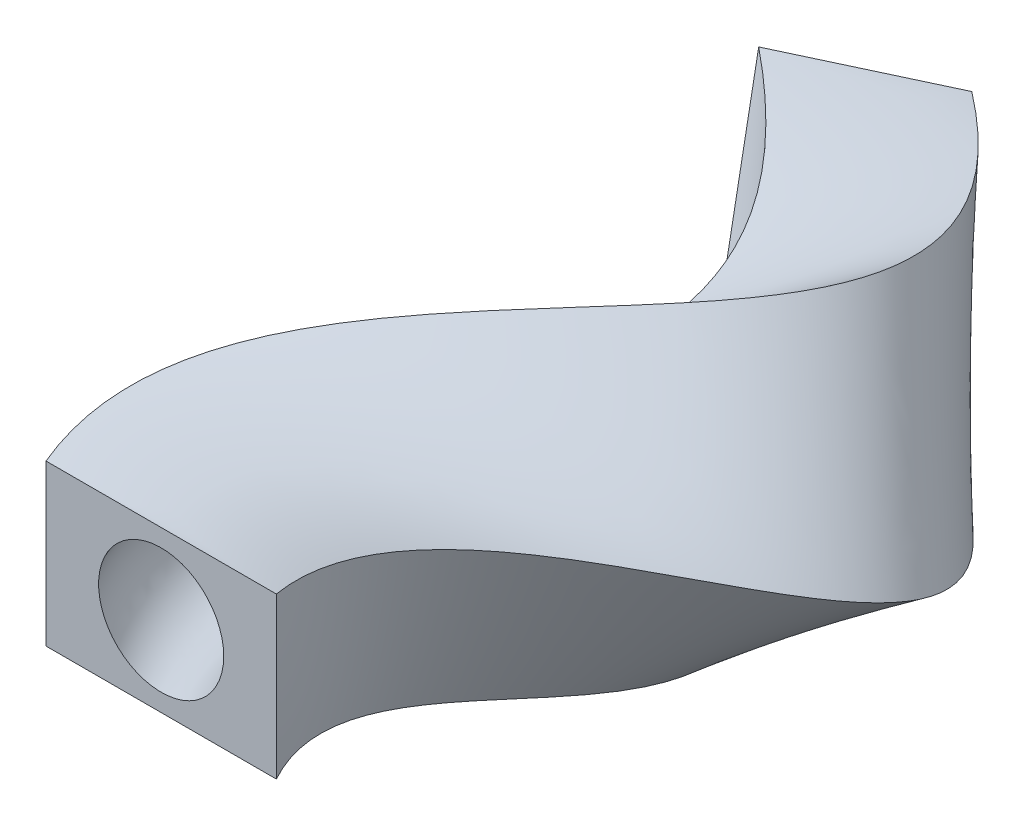
ISO-10303-21;
HEADER;
FILE_DESCRIPTION(('STEP AP214'),'2;1');
FILE_NAME('part.step','',(''),(''),'','','');
FILE_SCHEMA(('AUTOMOTIVE_DESIGN { 1 0 10303 214 1 1 1 1 }'));
ENDSEC;
DATA;
#1=APPLICATION_CONTEXT('core data for automotive mechanical design processes');
#2=APPLICATION_PROTOCOL_DEFINITION('international standard','automotive_design',2000,#1);
#3=PRODUCT_CONTEXT('',#1,'mechanical');
#4=PRODUCT('Part','Part','',(#3));
#5=PRODUCT_RELATED_PRODUCT_CATEGORY('part','',(#4));
#6=PRODUCT_DEFINITION_FORMATION('','',#4);
#7=PRODUCT_DEFINITION_CONTEXT('part definition',#1,'design');
#8=PRODUCT_DEFINITION('design','',#6,#7);
#9=PRODUCT_DEFINITION_SHAPE('','',#8);
#10=(LENGTH_UNIT() NAMED_UNIT(*) SI_UNIT(.MILLI.,.METRE.));
#11=(NAMED_UNIT(*) PLANE_ANGLE_UNIT() SI_UNIT($,.RADIAN.));
#12=(NAMED_UNIT(*) SI_UNIT($,.STERADIAN.) SOLID_ANGLE_UNIT());
#13=UNCERTAINTY_MEASURE_WITH_UNIT(LENGTH_MEASURE(1.E-05),#10,'distance_accuracy_value','');
#14=(GEOMETRIC_REPRESENTATION_CONTEXT(3) GLOBAL_UNCERTAINTY_ASSIGNED_CONTEXT((#13)) GLOBAL_UNIT_ASSIGNED_CONTEXT((#10,
#11,#12)) REPRESENTATION_CONTEXT('',''));
#15=CARTESIAN_POINT('',(0.,0.,0.));
#16=DIRECTION('',(0.,0.,1.));
#17=DIRECTION('',(1.,0.,0.));
#18=AXIS2_PLACEMENT_3D('',#15,#16,#17);
#19=CARTESIAN_POINT('',(61.2283301501087,-42.6063552254134,0.));
#20=CARTESIAN_POINT('',(38.3287198738814,-49.8660753150142,-35.7885541469527));
#21=CARTESIAN_POINT('',(38.4391921527666,-56.0138915681311,-64.3927159261914));
#22=CARTESIAN_POINT('',(55.857482325127,-65.159423486545,-114.541456645165));
#23=CARTESIAN_POINT('',(73.171139326201,-68.1534817331544,-136.088388994081));
#24=CARTESIAN_POINT('',(96.4340395376217,-70.5328991471328,-179.550974113554));
#25=CARTESIAN_POINT('',(102.389752617452,-69.9173221170335,-201.469653565411));
#26=CARTESIAN_POINT('',(74.4408587249949,-65.1683802950142,-253.135599398121));
#27=CARTESIAN_POINT('',(40.5410474525097,-61.0367607322027,-282.8866397748));
#28=CARTESIAN_POINT('',(-27.5984899072856,-55.4597251532579,-320.250022609733));
#29=CARTESIAN_POINT('',(61.2283301501087,-14.2021184084711,0.));
#30=CARTESIAN_POINT('',(41.6966039632517,-21.4618196168803,-37.3639680976946));
#31=CARTESIAN_POINT('',(45.1734788664111,-28.3489410064761,-67.5430926606875));
#32=CARTESIAN_POINT('',(68.8146629209892,-40.3401879846471,-120.602974669986));
#33=CARTESIAN_POINT('',(88.9822845483998,-45.4395553669786,-143.485024476688));
#34=CARTESIAN_POINT('',(117.00798154016,-53.0771685779317,-189.175700678509));
#35=CARTESIAN_POINT('',(124.870652816732,-55.6124093333956,-211.986477094894));
#36=CARTESIAN_POINT('',(99.4993659673522,-57.7336314010157,-264.858257131734));
#37=CARTESIAN_POINT('',(66.2706286783325,-57.3187762813602,-294.921771076642));
#38=CARTESIAN_POINT('',(-1.87034799661039,-55.459725153258,-332.285943138596));
#39=CARTESIAN_POINT('',(61.2283301501087,14.2021184084712,0.));
#40=CARTESIAN_POINT('',(45.0644284956187,6.94241720010483,-38.9394751265191));
#41=CARTESIAN_POINT('',(51.9077655799376,-0.683990445352002,-70.6934693956555));
#42=CARTESIAN_POINT('',(81.7718435169693,-15.5209524822181,-126.664492694335));
#43=CARTESIAN_POINT('',(104.793429770833,-22.7256290008615,-150.881659959763));
#44=CARTESIAN_POINT('',(137.581923542463,-35.6214380086719,-198.800427242996));
#45=CARTESIAN_POINT('',(147.351553016452,-41.3074965493174,-222.503300624378));
#46=CARTESIAN_POINT('',(124.557873209269,-50.2988825074573,-276.580914865348));
#47=CARTESIAN_POINT('',(92.0002730039314,-53.6006330371634,-306.956867766212));
#48=CARTESIAN_POINT('',(23.8577939140648,-55.4597251532581,-344.321863667458));
#49=CARTESIAN_POINT('',(61.2283301501087,42.6063552254134,0.));
#50=CARTESIAN_POINT('',(48.4322197480199,35.346635135812,-40.5150875268133));
#51=CARTESIAN_POINT('',(58.6420522935821,26.980960116008,-73.8438461303876));
#52=CARTESIAN_POINT('',(94.7290241128315,9.2982830199748,-132.726010718921));
#53=CARTESIAN_POINT('',(120.604574993267,-0.0117026347444312,-158.278295442839));
#54=CARTESIAN_POINT('',(158.155865544766,-18.1657074394121,-208.425153807483));
#55=CARTESIAN_POINT('',(169.832453215072,-27.0025837655694,-233.020124153421));
#56=CARTESIAN_POINT('',(149.616380452287,-42.8641336135688,-288.303572599401));
#57=CARTESIAN_POINT('',(117.729959910868,-49.8823223494118,-318.991941121501));
#58=CARTESIAN_POINT('',(49.58593582474,-55.4597251532582,-356.357784196321));
#59=B_SPLINE_SURFACE_WITH_KNOTS('',3,3,((#19,#20,#21,#22,#23,#24,#25,#26,#27,#28),(#29,#30,#31,
#32,#33,#34,#35,#36,#37,#38),(#39,#40,#41,#42,#43,#44,#45,#46,#47,#48),(#49,#50,#51,#52,#53,#54,
#55,#56,#57,#58)),.UNSPECIFIED.,.F.,.F.,.F.,(4,4),(4,2,2,2,4),(0.,1.),(0.,0.25,0.5,0.75,1.),.UNSPECIFIED.);
#60=CARTESIAN_POINT('',(61.2283301501087,42.6063552254134,0.));
#61=CARTESIAN_POINT('',(48.4322197480199,35.346635135812,-40.5150875268133));
#62=CARTESIAN_POINT('',(58.6420522935821,26.980960116008,-73.8438461303876));
#63=CARTESIAN_POINT('',(94.7290241128315,9.2982830199748,-132.726010718921));
#64=CARTESIAN_POINT('',(120.604574993267,-0.0117026347444312,-158.278295442839));
#65=CARTESIAN_POINT('',(158.155865544766,-18.1657074394121,-208.425153807483));
#66=CARTESIAN_POINT('',(169.832453215072,-27.0025837655694,-233.020124153421));
#67=CARTESIAN_POINT('',(149.616380452287,-42.8641336135688,-288.303572599401));
#68=CARTESIAN_POINT('',(117.729959910868,-49.8823223494118,-318.991941121501));
#69=CARTESIAN_POINT('',(49.58593582474,-55.4597251532582,-356.357784196321));
#70=B_SPLINE_CURVE_WITH_KNOTS('',3,(#60,#61,#62,#63,#64,#65,#66,#67,#68,#69),.UNSPECIFIED.,.F.,
.F.,(4,2,2,2,4),(0.,0.25,0.5,0.75,1.),.UNSPECIFIED.);
#71=CARTESIAN_POINT('',(61.2283301501087,42.6063552254134,0.));
#72=VERTEX_POINT('',#71);
#73=CARTESIAN_POINT('',(49.58593582474,-55.4597251532582,-356.357784196321));
#74=VERTEX_POINT('',#73);
#75=EDGE_CURVE('E224',#72,#74,#70,.T.);
#76=DIRECTION('',(0.,1.,0.));
#77=VECTOR('',#76,1.);
#78=CARTESIAN_POINT('',(61.2283301501087,-42.6063552254134,0.));
#79=LINE('',#78,#77);
#80=CARTESIAN_POINT('',(61.2283301501087,-42.6063552254134,0.));
#81=VERTEX_POINT('',#80);
#82=EDGE_CURVE('E116',#81,#72,#79,.T.);
#83=CARTESIAN_POINT('',(61.2283301501087,-42.6063552254134,0.));
#84=CARTESIAN_POINT('',(38.3287198738814,-49.8660753150142,-35.7885541469527));
#85=CARTESIAN_POINT('',(38.4391921527666,-56.0138915681311,-64.3927159261914));
#86=CARTESIAN_POINT('',(55.857482325127,-65.159423486545,-114.541456645165));
#87=CARTESIAN_POINT('',(73.171139326201,-68.1534817331544,-136.088388994081));
#88=CARTESIAN_POINT('',(96.4340395376217,-70.5328991471328,-179.550974113554));
#89=CARTESIAN_POINT('',(102.389752617452,-69.9173221170335,-201.469653565411));
#90=CARTESIAN_POINT('',(74.4408587249949,-65.1683802950142,-253.135599398121));
#91=CARTESIAN_POINT('',(40.5410474525097,-61.0367607322027,-282.8866397748));
#92=CARTESIAN_POINT('',(-27.5984899072856,-55.4597251532579,-320.250022609733));
#93=B_SPLINE_CURVE_WITH_KNOTS('',3,(#83,#84,#85,#86,#87,#88,#89,#90,#91,#92),.UNSPECIFIED.,.F.,
.F.,(4,2,2,2,4),(0.,0.25,0.5,0.75,1.),.UNSPECIFIED.);
#94=CARTESIAN_POINT('',(-27.5984899072856,-55.4597251532579,-320.250022609733));
#95=VERTEX_POINT('',#94);
#96=EDGE_CURVE('E113',#81,#95,#93,.T.);
#97=DIRECTION('',(0.90578536140528,0.,-0.423736803999731));
#98=VECTOR('',#97,1.);
#99=CARTESIAN_POINT('',(-27.5984899072856,-55.4597251532579,-320.250022609733));
#100=LINE('',#99,#98);
#101=EDGE_CURVE('E232',#95,#74,#100,.T.);
#102=ORIENTED_EDGE('',*,*,#75,.F.);
#103=ORIENTED_EDGE('',*,*,#82,.F.);
#104=ORIENTED_EDGE('',*,*,#96,.T.);
#105=ORIENTED_EDGE('',*,*,#101,.T.);
#106=EDGE_LOOP('',(#102,#103,#104,#105));
#107=FACE_BOUND('',#106,.T.);
#108=ADVANCED_FACE('F35',(#107),#59,.F.);
#109=CARTESIAN_POINT('',(61.2283301501087,42.6063552254134,0.));
#110=CARTESIAN_POINT('',(48.4322197480199,35.346635135812,-40.5150875268133));
#111=CARTESIAN_POINT('',(58.6420522935821,26.980960116008,-73.8438461303876));
#112=CARTESIAN_POINT('',(94.7290241128315,9.2982830199748,-132.726010718921));
#113=CARTESIAN_POINT('',(120.604574993267,-0.0117026347444312,-158.278295442839));
#114=CARTESIAN_POINT('',(158.155865544766,-18.1657074394121,-208.425153807483));
#115=CARTESIAN_POINT('',(169.832453215072,-27.0025837655694,-233.020124153421));
#116=CARTESIAN_POINT('',(149.616380452287,-42.8641336135688,-288.303572599401));
#117=CARTESIAN_POINT('',(117.729959910868,-49.8823223494118,-318.991941121501));
#118=CARTESIAN_POINT('',(49.58593582474,-55.4597251532582,-356.357784196321));
#119=CARTESIAN_POINT('',(20.4094433833696,42.6063552254134,0.));
#120=CARTESIAN_POINT('',(7.61338996696172,40.1864593054936,-40.5149070968973));
#121=CARTESIAN_POINT('',(18.6948137694612,36.6586039333824,-74.2516131976313));
#122=CARTESIAN_POINT('',(58.1369981481672,27.9186631754982,-134.703384789761));
#123=CARTESIAN_POINT('',(86.4947932127034,22.7100254877321,-161.416891875638));
#124=CARTESIAN_POINT('',(130.245708186668,11.4004947562593,-214.464005810105));
#125=CARTESIAN_POINT('',(145.637236807677,5.30405152842987,-240.796868235729));
#126=CARTESIAN_POINT('',(133.521363710032,-6.8532956438394,-299.869683195504));
#127=CARTESIAN_POINT('',(106.01655503443,-12.9091956922153,-332.608111191801));
#128=CARTESIAN_POINT('',(42.2567871855886,-18.4865750510861,-372.024668654417));
#129=CARTESIAN_POINT('',(-20.4094433833696,42.6063552254134,0.));
#130=CARTESIAN_POINT('',(-33.2054967996203,45.0262511453319,-40.514907096875));
#131=CARTESIAN_POINT('',(-21.2524247547482,46.3362477506387,-74.659380265111));
#132=CARTESIAN_POINT('',(21.5449721835914,46.5390433311396,-136.680758860365));
#133=CARTESIAN_POINT('',(52.385011432375,45.4317536102086,-164.555488309376));
#134=CARTESIAN_POINT('',(102.335550828336,40.9666969519307,-220.502857811788));
#135=CARTESIAN_POINT('',(121.442020400062,37.6106868223191,-248.573612317156));
#136=CARTESIAN_POINT('',(117.426346967998,29.1575423260001,-311.435793792486));
#137=CARTESIAN_POINT('',(94.3032236275085,24.0639344048109,-346.224272925668));
#138=CARTESIAN_POINT('',(34.9276385464371,18.4865750510859,-387.691553112514));
#139=CARTESIAN_POINT('',(-61.2283301501087,42.6063552254134,0.));
#140=CARTESIAN_POINT('',(-74.0244405525238,49.8660753150297,-40.5150875268965));
#141=CARTESIAN_POINT('',(-61.1996632788985,56.0138915678951,-75.0671473323547));
#142=CARTESIAN_POINT('',(-15.0470537810434,65.159423486781,-138.658132931205));
#143=CARTESIAN_POINT('',(18.2752296518119,68.1534817326851,-167.694084742174));
#144=CARTESIAN_POINT('',(74.4253934702384,70.5328991476021,-226.54170981441));
#145=CARTESIAN_POINT('',(97.2468039924473,69.9173221161533,-256.350356399464));
#146=CARTESIAN_POINT('',(101.331330225963,65.1683802958945,-323.001904388589));
#147=CARTESIAN_POINT('',(82.5899708727856,61.0370692877225,-359.840412020637));
#148=CARTESIAN_POINT('',(27.5984899072856,55.4597251532579,-403.358437570611));
#149=B_SPLINE_SURFACE_WITH_KNOTS('',3,3,((#109,#110,#111,#112,#113,#114,#115,#116,#117,#118),
(#119,#120,#121,#122,#123,#124,#125,#126,#127,#128),(#129,#130,#131,#132,#133,#134,#135,#136,
#137,#138),(#139,#140,#141,#142,#143,#144,#145,#146,#147,#148)),.UNSPECIFIED.,.F.,.F.,.F.,(4,4),
(4,2,2,2,4),(0.,1.),(0.,0.25,0.5,0.75,1.),.UNSPECIFIED.);
#150=CARTESIAN_POINT('',(-61.2283301501087,42.6063552254134,0.));
#151=CARTESIAN_POINT('',(-74.0244405525238,49.8660753150297,-40.5150875268965));
#152=CARTESIAN_POINT('',(-61.1996632788985,56.0138915678951,-75.0671473323547));
#153=CARTESIAN_POINT('',(-15.0470537810434,65.159423486781,-138.658132931205));
#154=CARTESIAN_POINT('',(18.2752296518119,68.1534817326851,-167.694084742174));
#155=CARTESIAN_POINT('',(74.4253934702384,70.5328991476021,-226.54170981441));
#156=CARTESIAN_POINT('',(97.2468039924473,69.9173221161533,-256.350356399464));
#157=CARTESIAN_POINT('',(101.331330225963,65.1683802958945,-323.001904388589));
#158=CARTESIAN_POINT('',(82.5899708727856,61.0370692877225,-359.840412020637));
#159=CARTESIAN_POINT('',(27.5984899072856,55.4597251532579,-403.358437570611));
#160=B_SPLINE_CURVE_WITH_KNOTS('',3,(#150,#151,#152,#153,#154,#155,#156,#157,#158,#159),
.UNSPECIFIED.,.F.,.F.,(4,2,2,2,4),(0.,0.25,0.5,0.75,1.),.UNSPECIFIED.);
#161=CARTESIAN_POINT('',(-61.2283301501087,42.6063552254134,0.));
#162=VERTEX_POINT('',#161);
#163=CARTESIAN_POINT('',(27.5984899072856,55.4597251532579,-403.358437570611));
#164=VERTEX_POINT('',#163);
#165=EDGE_CURVE('E107',#162,#164,#160,.T.);
#166=DIRECTION('',(-1.,0.,0.));
#167=VECTOR('',#166,1.);
#168=CARTESIAN_POINT('',(61.2283301501087,42.6063552254134,0.));
#169=LINE('',#168,#167);
#170=EDGE_CURVE('E89',#72,#162,#169,.T.);
#171=DIRECTION('',(-0.179552879063903,0.90578536140528,-0.383814594151616));
#172=VECTOR('',#171,1.);
#173=CARTESIAN_POINT('',(49.58593582474,-55.4597251532582,-356.357784196321));
#174=LINE('',#173,#172);
#175=EDGE_CURVE('E176',#74,#164,#174,.T.);
#176=ORIENTED_EDGE('',*,*,#165,.F.);
#177=ORIENTED_EDGE('',*,*,#170,.F.);
#178=ORIENTED_EDGE('',*,*,#75,.T.);
#179=ORIENTED_EDGE('',*,*,#175,.T.);
#180=EDGE_LOOP('',(#176,#177,#178,#179));
#181=FACE_BOUND('',#180,.T.);
#182=ADVANCED_FACE('F240',(#181),#149,.F.);
#183=CARTESIAN_POINT('',(-61.2283301501087,42.6063552254134,0.));
#184=CARTESIAN_POINT('',(-74.0244405525238,49.8660753150297,-40.5150875268965));
#185=CARTESIAN_POINT('',(-61.1996632788985,56.0138915678951,-75.0671473323547));
#186=CARTESIAN_POINT('',(-15.0470537810434,65.159423486781,-138.658132931205));
#187=CARTESIAN_POINT('',(18.2752296518119,68.1534817326851,-167.694084742174));
#188=CARTESIAN_POINT('',(74.4253934702384,70.5328991476021,-226.54170981441));
#189=CARTESIAN_POINT('',(97.2468039924473,69.9173221161533,-256.350356399464));
#190=CARTESIAN_POINT('',(101.331330225963,65.1683802958945,-323.001904388589));
#191=CARTESIAN_POINT('',(82.5899708727856,61.0370692877225,-359.840412020637));
#192=CARTESIAN_POINT('',(27.5984899072856,55.4597251532579,-403.358437570611));
#193=CARTESIAN_POINT('',(-61.2283301501087,14.2021184084712,0.));
#194=CARTESIAN_POINT('',(-77.3922318049194,21.4618196168468,-38.9394751265691));
#195=CARTESIAN_POINT('',(-67.933949992543,28.3489410067121,-71.9167705976227));
#196=CARTESIAN_POINT('',(-28.0042343769056,40.3401879844111,-132.59661490662));
#197=CARTESIAN_POINT('',(2.46408442949587,45.4395553666267,-160.297449259568));
#198=CARTESIAN_POINT('',(53.8514514678179,53.0771685782837,-216.916983249454));
#199=CARTESIAN_POINT('',(74.7659037929472,55.6124093324053,-245.8335328691));
#200=CARTESIAN_POINT('',(76.2728229838263,57.7336314020061,-311.279246655855));
#201=CARTESIAN_POINT('',(56.8602947011815,57.3187879945257,-347.805705648222));
#202=CARTESIAN_POINT('',(1.87034799661044,55.459725153258,-391.322517041748));
#203=CARTESIAN_POINT('',(-61.2283301501087,-14.2021184084712,0.));
#204=CARTESIAN_POINT('',(-80.7600563371826,-6.94241720009286,-37.3639680975356));
#205=CARTESIAN_POINT('',(-74.6682367061875,0.683990445351982,-68.7663938628907));
#206=CARTESIAN_POINT('',(-40.9614149727678,15.5209524822181,-126.535096882035));
#207=CARTESIAN_POINT('',(-13.3470607928202,22.7256290003922,-152.900813776492));
#208=CARTESIAN_POINT('',(33.2775094653973,35.6214380091412,-207.292256684967));
#209=CARTESIAN_POINT('',(52.285003593667,41.3074965485472,-235.316709339617));
#210=CARTESIAN_POINT('',(51.214315741469,50.2988825082276,-299.556588922242));
#211=CARTESIAN_POINT('',(31.130663965565,53.6007126425969,-335.770963310852));
#212=CARTESIAN_POINT('',(-23.8577939140648,55.4597251532581,-379.286596512886));
#213=CARTESIAN_POINT('',(-61.2283301501087,-42.6063552254134,0.));
#214=CARTESIAN_POINT('',(-84.1279404266066,-35.3466351358219,-35.7885541469067));
#215=CARTESIAN_POINT('',(-81.40252341995,-26.980960116008,-65.6160171281586));
#216=CARTESIAN_POINT('',(-53.9185955685119,-9.29828301997481,-120.47357885745));
#217=CARTESIAN_POINT('',(-29.158206015019,0.0117026342751,-145.504178293416));
#218=CARTESIAN_POINT('',(12.7035674628594,18.1657074398815,-197.667530120481));
#219=CARTESIAN_POINT('',(29.804103394607,27.0025837646892,-224.799885811014));
#220=CARTESIAN_POINT('',(26.1558084988916,42.8641336144492,-287.833931187748));
#221=CARTESIAN_POINT('',(5.40110362908267,49.8828314832076,-323.736165271325));
#222=CARTESIAN_POINT('',(-49.58593582474,55.4597251532582,-367.250675984023));
#223=B_SPLINE_SURFACE_WITH_KNOTS('',3,3,((#183,#184,#185,#186,#187,#188,#189,#190,#191,#192),
(#193,#194,#195,#196,#197,#198,#199,#200,#201,#202),(#203,#204,#205,#206,#207,#208,#209,#210,
#211,#212),(#213,#214,#215,#216,#217,#218,#219,#220,#221,#222)),.UNSPECIFIED.,.F.,.F.,.F.,(4,4),
(4,2,2,2,4),(0.,1.),(0.,0.25,0.5,0.75,1.),.UNSPECIFIED.);
#224=CARTESIAN_POINT('',(-61.2283301501087,-42.6063552254134,0.));
#225=CARTESIAN_POINT('',(-84.1279404266066,-35.3466351358219,-35.7885541469067));
#226=CARTESIAN_POINT('',(-81.40252341995,-26.980960116008,-65.6160171281586));
#227=CARTESIAN_POINT('',(-53.9185955685119,-9.29828301997481,-120.47357885745));
#228=CARTESIAN_POINT('',(-29.158206015019,0.0117026342751,-145.504178293416));
#229=CARTESIAN_POINT('',(12.7035674628594,18.1657074398815,-197.667530120481));
#230=CARTESIAN_POINT('',(29.804103394607,27.0025837646892,-224.799885811014));
#231=CARTESIAN_POINT('',(26.1558084988916,42.8641336144492,-287.833931187748));
#232=CARTESIAN_POINT('',(5.40110362908267,49.8828314832076,-323.736165271325));
#233=CARTESIAN_POINT('',(-49.58593582474,55.4597251532582,-367.250675984023));
#234=B_SPLINE_CURVE_WITH_KNOTS('',3,(#224,#225,#226,#227,#228,#229,#230,#231,#232,#233),
.UNSPECIFIED.,.F.,.F.,(4,2,2,2,4),(0.,0.25,0.5,0.75,1.),.UNSPECIFIED.);
#235=CARTESIAN_POINT('',(-61.2283301501087,-42.6063552254134,0.));
#236=VERTEX_POINT('',#235);
#237=CARTESIAN_POINT('',(-49.58593582474,55.4597251532582,-367.250675984023));
#238=VERTEX_POINT('',#237);
#239=EDGE_CURVE('E95',#236,#238,#234,.T.);
#240=DIRECTION('',(0.,-1.,0.));
#241=VECTOR('',#240,1.);
#242=CARTESIAN_POINT('',(-61.2283301501087,-42.6063552254134,0.));
#243=LINE('',#242,#241);
#244=EDGE_CURVE('E42',#162,#236,#243,.T.);
#245=DIRECTION('',(-0.90578536140528,0.,0.423736803999731));
#246=VECTOR('',#245,1.);
#247=CARTESIAN_POINT('',(-49.58593582474,55.4597251532582,-367.250675984023));
#248=LINE('',#247,#246);
#249=EDGE_CURVE('E102',#164,#238,#248,.T.);
#250=ORIENTED_EDGE('',*,*,#239,.F.);
#251=ORIENTED_EDGE('',*,*,#244,.F.);
#252=ORIENTED_EDGE('',*,*,#165,.T.);
#253=ORIENTED_EDGE('',*,*,#249,.T.);
#254=EDGE_LOOP('',(#250,#251,#252,#253));
#255=FACE_BOUND('',#254,.T.);
#256=ADVANCED_FACE('F101',(#255),#223,.F.);
#257=CARTESIAN_POINT('',(-61.2283301501087,-42.6063552254134,0.));
#258=CARTESIAN_POINT('',(-84.1279404266066,-35.3466351358219,-35.7885541469067));
#259=CARTESIAN_POINT('',(-81.40252341995,-26.980960116008,-65.6160171281586));
#260=CARTESIAN_POINT('',(-53.9185955685119,-9.29828301997481,-120.47357885745));
#261=CARTESIAN_POINT('',(-29.158206015019,0.0117026342751,-145.504178293416));
#262=CARTESIAN_POINT('',(12.7035674628594,18.1657074398815,-197.667530120481));
#263=CARTESIAN_POINT('',(29.804103394607,27.0025837646892,-224.799885811014));
#264=CARTESIAN_POINT('',(26.1558084988916,42.8641336144492,-287.833931187748));
#265=CARTESIAN_POINT('',(5.40110362908267,49.8828314832076,-323.736165271325));
#266=CARTESIAN_POINT('',(-49.58593582474,55.4597251532582,-367.250675984023));
#267=CARTESIAN_POINT('',(-20.4094433833695,-42.6063552254134,0.));
#268=CARTESIAN_POINT('',(-43.3089516783581,-40.1864593054806,-35.7883947663787));
#269=CARTESIAN_POINT('',(-41.4552848955931,-36.6586039333824,-65.2082500609149));
#270=CARTESIAN_POINT('',(-17.3265696040836,-27.9186631754982,-118.49620478661));
#271=CARTESIAN_POINT('',(4.95157576542685,-22.7100254882014,-142.365581860618));
#272=CARTESIAN_POINT('',(40.6137248210744,-11.40049475579,-191.628678117859));
#273=CARTESIAN_POINT('',(53.999319802112,-5.30405152931011,-217.023141729146));
#274=CARTESIAN_POINT('',(42.2508252410361,6.85329564471972,-276.267820591205));
#275=CARTESIAN_POINT('',(17.1142995996124,12.9096382366721,-310.119652899964));
#276=CARTESIAN_POINT('',(-42.2567871855886,18.4865750510861,-351.583791525926));
#277=CARTESIAN_POINT('',(20.4094433833695,-42.6063552254134,0.));
#278=CARTESIAN_POINT('',(-2.49006491175654,-45.0262511453449,-35.7883947663591));
#279=CARTESIAN_POINT('',(-1.50804637138383,-46.3362477506387,-64.8004829934352));
#280=CARTESIAN_POINT('',(19.2654563604922,-46.5390433311396,-116.518830716005));
#281=CARTESIAN_POINT('',(39.0613575456379,-45.4317536106779,-139.226985427349));
#282=CARTESIAN_POINT('',(68.523882179524,-40.9666969514614,-185.589826115706));
#283=CARTESIAN_POINT('',(78.194536209837,-37.6106868233093,-209.246397647278));
#284=CARTESIAN_POINT('',(58.3458419829605,-29.1575423250097,-264.701709994663));
#285=CARTESIAN_POINT('',(28.8276185709891,-24.0635598364653,-296.503138157456));
#286=CARTESIAN_POINT('',(-34.9276385464371,-18.4865750510858,-335.91690706783));
#287=CARTESIAN_POINT('',(61.2283301501087,-42.6063552254134,0.));
#288=CARTESIAN_POINT('',(38.3287198738814,-49.8660753150142,-35.7885541469527));
#289=CARTESIAN_POINT('',(38.4391921527666,-56.0138915681311,-64.3927159261914));
#290=CARTESIAN_POINT('',(55.857482325127,-65.159423486545,-114.541456645165));
#291=CARTESIAN_POINT('',(73.171139326201,-68.1534817331544,-136.088388994081));
#292=CARTESIAN_POINT('',(96.4340395376217,-70.5328991471328,-179.550974113554));
#293=CARTESIAN_POINT('',(102.389752617452,-69.9173221170335,-201.469653565411));
#294=CARTESIAN_POINT('',(74.4408587249949,-65.1683802950142,-253.135599398121));
#295=CARTESIAN_POINT('',(40.5410474525097,-61.0367607322027,-282.8866397748));
#296=CARTESIAN_POINT('',(-27.5984899072856,-55.4597251532579,-320.250022609733));
#297=B_SPLINE_SURFACE_WITH_KNOTS('',3,3,((#257,#258,#259,#260,#261,#262,#263,#264,#265,#266),
(#267,#268,#269,#270,#271,#272,#273,#274,#275,#276),(#277,#278,#279,#280,#281,#282,#283,#284,
#285,#286),(#287,#288,#289,#290,#291,#292,#293,#294,#295,#296)),.UNSPECIFIED.,.F.,.F.,.F.,(4,4),
(4,2,2,2,4),(0.,1.),(0.,0.25,0.5,0.75,1.),.UNSPECIFIED.);
#298=DIRECTION('',(0.179552879063903,-0.90578536140528,0.383814594151616));
#299=VECTOR('',#298,1.);
#300=CARTESIAN_POINT('',(-27.5984899072856,-55.4597251532579,-320.250022609733));
#301=LINE('',#300,#299);
#302=EDGE_CURVE('E132',#238,#95,#301,.T.);
#303=DIRECTION('',(1.,0.,0.));
#304=VECTOR('',#303,1.);
#305=CARTESIAN_POINT('',(61.2283301501087,-42.6063552254134,0.));
#306=LINE('',#305,#304);
#307=EDGE_CURVE('E85',#236,#81,#306,.T.);
#308=ORIENTED_EDGE('',*,*,#302,.T.);
#309=ORIENTED_EDGE('',*,*,#96,.F.);
#310=ORIENTED_EDGE('',*,*,#307,.F.);
#311=ORIENTED_EDGE('',*,*,#239,.T.);
#312=EDGE_LOOP('',(#308,#309,#310,#311));
#313=FACE_BOUND('',#312,.T.);
#314=ADVANCED_FACE('F37',(#313),#297,.F.);
#315=CARTESIAN_POINT('',(0.,0.,0.));
#316=DIRECTION('',(0.,0.,1.));
#317=DIRECTION('',(1.,0.,0.));
#318=AXIS2_PLACEMENT_3D('',#315,#316,#317);
#319=PLANE('',#318);
#320=CARTESIAN_POINT('',(0.,0.,0.));
#321=DIRECTION('',(0.,0.,1.));
#322=DIRECTION('',(1.,0.,0.));
#323=AXIS2_PLACEMENT_3D('',#320,#321,#322);
#324=CIRCLE('',#323,33.2587330318302);
#325=CARTESIAN_POINT('',(33.2587330318302,0.,0.));
#326=VERTEX_POINT('',#325);
#327=EDGE_CURVE('E49',#326,#326,#324,.F.);
#328=ORIENTED_EDGE('',*,*,#327,.T.);
#329=EDGE_LOOP('',(#328));
#330=FACE_BOUND('',#329,.T.);
#331=ORIENTED_EDGE('',*,*,#244,.T.);
#332=ORIENTED_EDGE('',*,*,#307,.T.);
#333=ORIENTED_EDGE('',*,*,#82,.T.);
#334=ORIENTED_EDGE('',*,*,#170,.T.);
#335=EDGE_LOOP('',(#331,#332,#333,#334));
#336=FACE_BOUND('',#335,.T.);
#337=ADVANCED_FACE('F83',(#330,#336),#319,.T.);
#338=CARTESIAN_POINT('',(0.,0.,-361.804230090172));
#339=DIRECTION('',(0.383814594151616,0.423736803999731,0.820447120936093));
#340=DIRECTION('',(0.179552879063903,-0.90578536140528,0.383814594151616));
#341=AXIS2_PLACEMENT_3D('',#338,#339,#340);
#342=PLANE('',#341);
#343=CARTESIAN_POINT('',(0.,0.,-361.804230090172));
#344=DIRECTION('',(0.383814594151616,0.423736803999731,0.820447120936093));
#345=DIRECTION('',(0.179552879063903,-0.90578536140528,0.383814594151616));
#346=AXIS2_PLACEMENT_3D('',#343,#344,#345);
#347=CIRCLE('',#346,33.2587330318302);
#348=CARTESIAN_POINT('',(5.97170126988285,-30.1252735191181,-349.039042969563));
#349=VERTEX_POINT('',#348);
#350=EDGE_CURVE('E11',#349,#349,#347,.F.);
#351=ORIENTED_EDGE('',*,*,#350,.F.);
#352=EDGE_LOOP('',(#351));
#353=FACE_BOUND('',#352,.T.);
#354=ORIENTED_EDGE('',*,*,#249,.F.);
#355=ORIENTED_EDGE('',*,*,#175,.F.);
#356=ORIENTED_EDGE('',*,*,#101,.F.);
#357=ORIENTED_EDGE('',*,*,#302,.F.);
#358=EDGE_LOOP('',(#354,#355,#356,#357));
#359=FACE_BOUND('',#358,.T.);
#360=ADVANCED_FACE('F193',(#353,#359),#342,.F.);
#361=CARTESIAN_POINT('',(33.2587330318302,0.,0.));
#362=CARTESIAN_POINT('',(15.4109893085496,-3.94339538804881,-38.151571556354));
#363=CARTESIAN_POINT('',(21.1682890702857,-7.88522660943356,-69.3976879758555));
#364=CARTESIAN_POINT('',(50.2199524741529,-15.171659533033,-124.988654419199));
#365=CARTESIAN_POINT('',(73.515420286574,-18.5133880300161,-149.333946624472));
#366=CARTESIAN_POINT('',(108.17057364078,-24.0901823509198,-198.125958718615));
#367=CARTESIAN_POINT('',(119.532246688075,-26.3230539469949,-222.573608382945));
#368=CARTESIAN_POINT('',(101.000118579554,-29.34119328424,-278.644825495824));
#369=CARTESIAN_POINT('',(71.1092579965913,-30.1252714975972,-310.269403145199));
#370=CARTESIAN_POINT('',(5.97170126988286,-30.1252735191181,-349.039042969563));
#371=CARTESIAN_POINT('',(33.2587330318302,-4.35355797335425,0.));
#372=CARTESIAN_POINT('',(14.8948000590795,-8.2969533613816,-37.9100922919802));
#373=CARTESIAN_POINT('',(20.1361153207811,-12.1254731217908,-68.9148252309715));
#374=CARTESIAN_POINT('',(48.2339868853314,-18.9757392310424,-124.059596888331));
#375=CARTESIAN_POINT('',(71.09202346044,-21.9947839877826,-148.200253732534));
#376=CARTESIAN_POINT('',(105.01717614502,-26.7656471236484,-196.650763121942));
#377=CARTESIAN_POINT('',(116.086566983991,-28.5155883745288,-220.96167980927));
#378=CARTESIAN_POINT('',(97.1593653599189,-30.4807278731932,-276.848076990786));
#379=CARTESIAN_POINT('',(67.1656374301696,-30.695153911347,-308.424778183088));
#380=CARTESIAN_POINT('',(2.02831218758934,-30.125273519118,-347.194280227906));
#381=CARTESIAN_POINT('',(32.3930972336086,-8.70540300755169,0.));
#382=CARTESIAN_POINT('',(13.5131777809855,-12.5461624359361,-37.6687086970326));
#383=CARTESIAN_POINT('',(18.2571967130532,-16.158819935672,-68.4407998851511));
#384=CARTESIAN_POINT('',(45.4728048578446,-22.3834444980212,-123.172838573044));
#385=CARTESIAN_POINT('',(67.9462226301805,-24.9929562285945,-147.13356631973));
#386=CARTESIAN_POINT('',(101.273135735057,-28.8130562501557,-195.304212358017));
#387=CARTESIAN_POINT('',(112.129141178473,-30.0221414972399,-219.515304903761));
#388=CARTESIAN_POINT('',(92.9788003671338,-30.8561413793953,-275.297315008912));
#389=CARTESIAN_POINT('',(62.9751673089899,-30.4807256561767,-306.869636853469));
#390=CARTESIAN_POINT('',(-2.06895273928243,-29.3411932847805,-345.682486974191));
#391=CARTESIAN_POINT('',(29.0610282171214,-16.7497292179183,0.));
#392=CARTESIAN_POINT('',(9.22731413652069,-20.1954147086767,-37.2225155293109));
#393=CARTESIAN_POINT('',(13.0890724376183,-23.203782280303,-67.5818721297286));
#394=CARTESIAN_POINT('',(38.816190980747,-27.8924749879002,-121.617578271828));
#395=CARTESIAN_POINT('',(60.683968228303,-29.570949537695,-145.294980419411));
#396=CARTESIAN_POINT('',(93.168094856761,-31.3431645825163,-193.071361255961));
#397=CARTESIAN_POINT('',(103.787285949708,-31.4362077890268,-217.171669326925));
#398=CARTESIAN_POINT('',(84.5681683893243,-30.0221414962099,-272.921504877526));
#399=CARTESIAN_POINT('',(54.7321425705849,-28.5155685750261,-304.572725697838));
#400=CARTESIAN_POINT('',(-9.95366824815124,-26.3230539464543,-343.552706612727));
#401=CARTESIAN_POINT('',(26.5959060257277,-20.4390452952326,0.));
#402=CARTESIAN_POINT('',(6.32475912000188,-23.5924482195911,-37.0178813828743));
#403=CARTESIAN_POINT('',(9.80190020617175,-26.2126259191599,-67.1973076715447));
#404=CARTESIAN_POINT('',(34.9233782243985,-29.9916326425937,-120.949688214391));
#405=CARTESIAN_POINT('',(56.5703720430998,-31.1489693609195,-144.523805336028));
#406=CARTESIAN_POINT('',(88.8102833764912,-31.8248682989681,-192.1859394503));
#407=CARTESIAN_POINT('',(99.4061386903196,-31.3431645834418,-216.275330775534));
#408=CARTESIAN_POINT('',(80.3414106287917,-28.8130562501217,-272.097391508435));
#409=CARTESIAN_POINT('',(50.6828312161095,-26.7656138045987,-303.831860816156));
#410=CARTESIAN_POINT('',(-13.7380165312887,-24.0901823514146,-342.935557482605));
#411=CARTESIAN_POINT('',(20.4390452952326,-26.5959060257277,0.));
#412=CARTESIAN_POINT('',(-0.562105401512265,-29.0193072389101,-36.6763813462882));
#413=CARTESIAN_POINT('',(2.31679922612364,-30.749525929355,-66.5759416150162));
#414=CARTESIAN_POINT('',(26.5954907682388,-32.5628342738598,-119.934056956103));
#415=CARTESIAN_POINT('',(47.9982692914708,-32.6452060819862,-143.393927355742));
#416=CARTESIAN_POINT('',(80.1409156130876,-31.1489693600228,-191.010559779001));
#417=CARTESIAN_POINT('',(90.883759480748,-29.5709495375833,-215.168714039601));
#418=CARTESIAN_POINT('',(72.4820955881776,-24.9929562278143,-271.300963812542));
#419=CARTESIAN_POINT('',(43.3389485483454,-21.9947193027826,-303.276982475904));
#420=CARTESIAN_POINT('',(-20.4202929233381,-18.5133880295211,-342.689761996517));
#421=CARTESIAN_POINT('',(16.7497292179183,-29.0610282171214,0.));
#422=CARTESIAN_POINT('',(-4.54370511130158,-31.0469974844325,-36.5396496579233));
#423=CARTESIAN_POINT('',(-1.87818445491848,-32.2757972243789,-66.3393844971601));
#424=CARTESIAN_POINT('',(22.1636927365713,-33.0338665922809,-119.586715363304));
#425=CARTESIAN_POINT('',(43.5431354811786,-32.5628342744032,-143.03566901698));
#426=CARTESIAN_POINT('',(75.8327703562226,-29.9916326421638,-190.72106437567));
#427=CARTESIAN_POINT('',(86.74588072259,-27.8924749883865,-214.95887126121));
#428=CARTESIAN_POINT('',(68.8526306132269,-22.383444497695,-271.32896284631));
#429=CARTESIAN_POINT('',(40.047266641599,-18.9756582525669,-303.463187759438));
#430=CARTESIAN_POINT('',(-23.3155918418363,-15.1716595330926,-343.061212350578));
#431=CARTESIAN_POINT('',(8.70540300755167,-32.3930972336086,0.));
#432=CARTESIAN_POINT('',(-12.983106928432,-33.4252729594451,-36.3548316630768));
#433=CARTESIAN_POINT('',(-10.5407233680989,-33.6139330009384,-66.0501774885072));
#434=CARTESIAN_POINT('',(13.4323770741841,-32.2757972243229,-119.265333800725));
#435=CARTESIAN_POINT('',(34.9662093175364,-30.7495259297738,-142.78651263661));
#436=CARTESIAN_POINT('',(67.9189083615675,-26.2126259186275,-190.782097035488));
#437=CARTESIAN_POINT('',(79.3404325111262,-23.2037822805697,-215.257745732885));
#438=CARTESIAN_POINT('',(62.7411419800569,-16.1588199352446,-272.23316648281));
#439=CARTESIAN_POINT('',(34.7205647909983,-12.1253646564091,-304.734820892318));
#440=CARTESIAN_POINT('',(-27.7781131113631,-7.88522660937369,-344.73682187448));
#441=CARTESIAN_POINT('',(4.35355797335424,-33.2587330318302,0.));
#442=CARTESIAN_POINT('',(-17.437588400846,-33.7749224533652,-36.3068179661921));
#443=CARTESIAN_POINT('',(-15.0048702610128,-33.4252709831093,-65.9976413881323));
#444=CARTESIAN_POINT('',(9.13629484326288,-31.0469938059468,-119.291420281053));
#445=CARTESIAN_POINT('',(30.8477916183379,-29.0193028523407,-142.89571262741));
#446=CARTESIAN_POINT('',(64.3163053905766,-23.592442790513,-191.132601084879));
#447=CARTESIAN_POINT('',(76.075776785101,-20.1954089223157,-215.766345388509));
#448=CARTESIAN_POINT('',(60.2615229320051,-12.546156226873,-273.109015320123));
#449=CARTESIAN_POINT('',(32.6876405607736,-8.29682883549209,-305.81974774767));
#450=CARTESIAN_POINT('',(-29.3435796508307,-3.9433890822934,-346.040321763526));
#451=CARTESIAN_POINT('',(-4.35355797335426,-33.2587330318302,0.));
#452=CARTESIAN_POINT('',(-26.1447043476041,-32.7425436102949,-36.3068179662136));
#453=CARTESIAN_POINT('',(-23.5260540838007,-31.360923484157,-66.0846225729105));
#454=CARTESIAN_POINT('',(1.33081463456918,-27.0750626282467,-119.713215843598));
#455=CARTESIAN_POINT('',(23.5718013009045,-24.1725092000728,-143.565209647645));
#456=CARTESIAN_POINT('',(58.3627629141822,-17.2856477989939,-192.420754406232));
#457=CARTESIAN_POINT('',(70.9146719312585,-13.3040495141488,-217.425210139043));
#458=CARTESIAN_POINT('',(56.8282794500234,-4.86464978760205,-275.576193481727));
#459=CARTESIAN_POINT('',(30.1890606222713,-0.410043134978017,-308.724292115401));
#460=CARTESIAN_POINT('',(-30.9069673874054,3.94338908229364,-349.382239936842));
#461=CARTESIAN_POINT('',(-8.70540300755169,-32.3930972336086,0.));
#462=CARTESIAN_POINT('',(-30.3939129435931,-31.3609215077729,-36.3548316630504));
#463=CARTESIAN_POINT('',(-27.5797382916858,-29.4860502355856,-66.2241056348261));
#464=CARTESIAN_POINT('',(-2.17551222007728,-24.3334976542689,-120.10875896713));
#465=CARTESIAN_POINT('',(20.4170914743098,-21.0578456317178,-144.125243258609));
#466=CARTESIAN_POINT('',(56.0141658733651,-13.6015173899601,-193.357896844851));
#467=CARTESIAN_POINT('',(69.0202534777939,-9.42377491980266,-218.574822541297));
#468=CARTESIAN_POINT('',(55.8760058508152,-0.798829401556291,-277.166552076977));
#469=CARTESIAN_POINT('',(29.7243879454036,3.64510315008228,-310.542765337379));
#470=CARTESIAN_POINT('',(-30.904273458198,7.88522660937393,-351.41934331902));
#471=CARTESIAN_POINT('',(-16.7497292179183,-29.0610282171214,0.));
#472=CARTESIAN_POINT('',(-38.0431635469022,-27.075058949658,-36.5396496580227));
#473=CARTESIAN_POINT('',(-34.6622940318475,-24.3334976544326,-66.6740329162791));
#474=CARTESIAN_POINT('',(-7.86684337009607,-17.7523951830332,-121.209517103849));
#475=CARTESIAN_POINT('',(15.5497405722216,-13.915447069003,-145.611468826991));
#476=CARTESIAN_POINT('',(52.9273157879415,-5.72708649675035,-195.677061161835));
#477=CARTESIAN_POINT('',(66.8892234102593,-1.37889581073168,-221.341130449895));
#478=CARTESIAN_POINT('',(55.643687717503,7.17011919206664,-280.821099253779));
#479=CARTESIAN_POINT('',(30.4343156077507,11.3676854010033,-314.638018027027));
#480=CARTESIAN_POINT('',(-29.3305160510723,15.1716595330928,-355.918793394428));
#481=CARTESIAN_POINT('',(-20.4390452952326,-26.5959060257277,0.));
#482=CARTESIAN_POINT('',(-41.4401959918737,-24.1725048128173,-36.67638134662));
#483=CARTESIAN_POINT('',(-37.6883788808701,-21.0578456313062,-66.984300108509));
#484=CARTESIAN_POINT('',(-10.0496083697019,-13.9154470685328,-121.914299015849));
#485=CARTESIAN_POINT('',(13.8390145914962,-9.89052230355038,-146.537076017961));
#486=CARTESIAN_POINT('',(52.1902772869951,-1.53988426480939,-197.058170548226));
#487=CARTESIAN_POINT('',(66.6534502656517,2.78254338754125,-222.95673753127));
#488=CARTESIAN_POINT('',(56.3637345905339,11.0701119587174,-282.883849928004));
#489=CARTESIAN_POINT('',(31.6086366710123,15.0320837215951,-316.913184716702));
#490=CARTESIAN_POINT('',(-27.7600717794912,18.5133880295213,-358.379369746189));
#491=CARTESIAN_POINT('',(-26.5959060257277,-20.4390452952326,0.));
#492=CARTESIAN_POINT('',(-46.8670529314087,-17.2856423707342,-37.0178813827924));
#493=CARTESIAN_POINT('',(-42.2540516304663,-13.6015173904882,-67.7286761368021));
#494=CARTESIAN_POINT('',(-12.7603368855281,-5.72708649710421,-123.526439278658));
#495=CARTESIAN_POINT('',(12.1213131568605,-1.53988426563205,-148.613765764224));
#496=CARTESIAN_POINT('',(52.4400645357723,6.7033718085678,-200.055274117005));
#497=CARTESIAN_POINT('',(67.8769249942174,10.7561822800581,-226.409343295959));
#498=CARTESIAN_POINT('',(59.3677101358728,18.113302522125,-287.169394440419));
#499=CARTESIAN_POINT('',(35.4189922613762,21.4147766244976,-321.575668407679));
#500=CARTESIAN_POINT('',(-23.2887595277536,24.0901823514147,-363.351351237324));
#501=CARTESIAN_POINT('',(-29.0610282171214,-16.7497292179183,0.));
#502=CARTESIAN_POINT('',(-48.8947422975711,-13.3040437270137,-37.2225155293033));
#503=CARTESIAN_POINT('',(-43.7918431337532,-9.42377491955467,-68.1624920923139));
#504=CARTESIAN_POINT('',(-13.2872338458543,-1.37889581040614,-124.433163321485));
#505=CARTESIAN_POINT('',(12.1150135448062,2.78254338732928,-149.764031230798));
#506=CARTESIAN_POINT('',(53.4267920051891,10.7561822807682,-201.670089067105));
#507=CARTESIAN_POINT('',(69.3356914826164,14.5652446878383,-228.244983525251));
#508=CARTESIAN_POINT('',(61.6504568717929,21.2537291242035,-289.39050210093));
#509=CARTESIAN_POINT('',(38.0535276910731,24.1305616852072,-323.961150416601));
#510=CARTESIAN_POINT('',(-20.3896508180342,26.3230539464544,-365.860800114293));
#511=CARTESIAN_POINT('',(-32.3930972336086,-8.70540300755168,0.));
#512=CARTESIAN_POINT('',(-51.2730166857152,-4.86464357915282,-37.6687086971746));
#513=CARTESIAN_POINT('',(-45.1455506045378,-0.798829401904989,-69.0879923645299));
#514=CARTESIAN_POINT('',(-12.6046758838152,7.17011919184134,-126.311251969854));
#515=CARTESIAN_POINT('',(13.8084660501313,11.0701119580121,-152.115027966553));
#516=CARTESIAN_POINT('',(56.9751887437805,18.1133025223319,-204.888850037904));
#517=CARTESIAN_POINT('',(73.7274080706198,21.2537291236073,-231.858259215854));
#518=CARTESIAN_POINT('',(67.4333980501758,26.298899740823,-293.654608645954));
#519=CARTESIAN_POINT('',(44.3842199904679,28.2016730193393,-328.481040044761));
#520=CARTESIAN_POINT('',(-13.7015004794652,29.3411932847806,-370.548373910254));
#521=CARTESIAN_POINT('',(-33.2587330318302,-4.35355797335424,0.));
#522=CARTESIAN_POINT('',(-51.6226660040827,-0.410162585270944,-37.9100922921649));
#523=CARTESIAN_POINT('',(-44.9609339459792,3.64498009697655,-69.5793125362278));
#524=CARTESIAN_POINT('',(-11.3954895188341,11.3675798351234,-127.281877627881));
#525=CARTESIAN_POINT('',(15.5075518656598,15.0319920713994,-153.314834218822));
#526=CARTESIAN_POINT('',(59.5354618709661,21.4147175790414,-206.491529613698));
#527=CARTESIAN_POINT('',(76.6586302177678,24.1305195186675,-233.634473007264));
#528=CARTESIAN_POINT('',(70.931317151742,28.2016586960803,-295.69592978684));
#529=CARTESIAN_POINT('',(48.0778860997572,29.5553991033099,-330.613670168994));
#530=CARTESIAN_POINT('',(-9.91509035217637,30.1252735191181,-372.724654469124));
#531=CARTESIAN_POINT('',(-33.2587330318302,4.35355797335425,0.));
#532=CARTESIAN_POINT('',(-50.5902875051329,8.29695336140594,-38.3930508209045));
#533=CARTESIAN_POINT('',(-42.8965864469698,12.1254731216482,-70.5450380259957));
#534=CARTESIAN_POINT('',(-7.423558341191,18.9757392311849,-129.139992689619));
#535=CARTESIAN_POINT('',(20.3543455180411,21.994783986819,-155.582220002699));
#536=CARTESIAN_POINT('',(65.8422568623718,26.765647124612,-209.441920807045));
#537=CARTESIAN_POINT('',(83.5499896257232,28.5155883736297,-236.85833015419));
#538=CARTESIAN_POINT('',(78.6128235912245,30.4807278740925,-299.289426797337));
#539=CARTESIAN_POINT('',(55.9651253500307,30.6951524568768,-334.302860837689));
#540=CARTESIAN_POINT('',(-2.02831218758934,30.125273519118,-376.414179952438));
#541=CARTESIAN_POINT('',(-32.3930972336086,8.70540300755165,0.));
#542=CARTESIAN_POINT('',(-49.2086658501233,12.5461624359412,-38.6344357477607));
#543=CARTESIAN_POINT('',(-41.017667839242,16.1588199355579,-71.019063371588));
#544=CARTESIAN_POINT('',(-4.66237631370422,22.3834444981352,-130.026751005134));
#545=CARTESIAN_POINT('',(23.5001463481873,24.9929562276876,-156.648907415049));
#546=CARTESIAN_POINT('',(69.586297272448,28.8130562510626,-210.788471571423));
#547=CARTESIAN_POINT('',(87.5074154314529,30.0221414963407,-238.304705058853));
#548=CARTESIAN_POINT('',(82.7933885837979,30.8561413802945,-300.840188780058));
#549=CARTESIAN_POINT('',(60.1555952220949,30.48073163051,-335.857971586308));
#550=CARTESIAN_POINT('',(2.0689527392824,29.3411932847805,-377.925973206153));
#551=CARTESIAN_POINT('',(-29.0610282171214,16.7497292179183,0.));
#552=CARTESIAN_POINT('',(-44.9228044495526,20.195414708673,-39.0806337117369));
#553=CARTESIAN_POINT('',(-35.849543563693,23.2037822801319,-71.8779911272386));
#554=CARTESIAN_POINT('',(1.99423756327934,27.8924749880712,-131.582011306121));
#555=CARTESIAN_POINT('',(30.7624007501781,29.5709495367881,-158.487493315821));
#556=CARTESIAN_POINT('',(77.6913381506308,31.3431645834232,-213.021322673026));
#557=CARTESIAN_POINT('',(95.8492706602183,31.4362077881276,-240.648340636536));
#558=CARTESIAN_POINT('',(91.2040205616074,30.0221414971092,-303.215998910598));
#559=CARTESIAN_POINT('',(68.3986209564403,28.5156127582314,-338.154831889672));
#560=CARTESIAN_POINT('',(9.95366824815121,26.3230539464543,-380.055753567617));
#561=CARTESIAN_POINT('',(-26.5959060257277,20.4390452952326,0.));
#562=CARTESIAN_POINT('',(-42.0202509355747,23.5924482195758,-39.2852710699996));
#563=CARTESIAN_POINT('',(-32.5623713323035,26.2126259189888,-72.2625555854225));
#564=CARTESIAN_POINT('',(5.88705031968486,29.9916326427648,-132.249901363558));
#565=CARTESIAN_POINT('',(34.8759969350412,31.1489693601259,-159.258668399205));
#566=CARTESIAN_POINT('',(82.0491496312408,31.8248682997617,-213.906744478687));
#567=CARTESIAN_POINT('',(100.230417919395,31.3431645825955,-241.544679187504));
#568=CARTESIAN_POINT('',(95.4307783223517,28.8130562509681,-304.040112280112));
#569=CARTESIAN_POINT('',(72.4479334944385,26.7656867406948,-338.895679158045));
#570=CARTESIAN_POINT('',(13.7380165312887,24.0901823514146,-380.672902697739));
#571=CARTESIAN_POINT('',(-20.4390452952326,26.5959060257277,0.));
#572=CARTESIAN_POINT('',(-35.1333895830698,29.0193072389309,-39.6267778808027));
#573=CARTESIAN_POINT('',(-25.0772703521984,30.7495259292409,-72.883921641951));
#574=CARTESIAN_POINT('',(14.2149377757876,32.5628342739738,-133.265532621846));
#575=CARTESIAN_POINT('',(43.4480996866703,32.6452060810793,-160.38854637949));
#576=CARTESIAN_POINT('',(90.7185173946443,31.1489693609297,-215.082124149986));
#577=CARTESIAN_POINT('',(108.752797129178,29.5709495367371,-242.65129592386));
#578=CARTESIAN_POINT('',(103.290093362754,24.9929562286607,-304.836539975581));
#579=CARTESIAN_POINT('',(79.7918194422725,21.9948575771591,-339.450544866967));
#580=CARTESIAN_POINT('',(20.4202929233381,18.5133880295211,-380.918698183827));
#581=CARTESIAN_POINT('',(-16.7497292179183,29.0610282171214,0.));
#582=CARTESIAN_POINT('',(-31.1517913736554,31.0469974844352,-39.7635127763305));
#583=CARTESIAN_POINT('',(-20.8822866710707,32.2757972242648,-73.1204787598071));
#584=CARTESIAN_POINT('',(18.6467358073695,33.0338665923949,-133.612874214645));
#585=CARTESIAN_POINT('',(47.9032334971892,32.5628342733829,-160.746804718252));
#586=CARTESIAN_POINT('',(95.0266626512827,29.991632643184,-215.371619553317));
#587=CARTESIAN_POINT('',(112.890675887125,27.8924749875402,-242.861138701828));
#588=CARTESIAN_POINT('',(106.919558337916,22.3834444985414,-304.808540942237));
#589=CARTESIAN_POINT('',(83.083503277983,18.9758296818499,-339.264345206294));
#590=CARTESIAN_POINT('',(23.3155918418363,15.1716595330926,-380.547247829766));
#591=CARTESIAN_POINT('',(-8.70540300755165,32.3930972336086,0.));
#592=CARTESIAN_POINT('',(-22.7123917941477,33.4252729594412,-39.948335555084));
#593=CARTESIAN_POINT('',(-12.2197477580043,33.6139330007103,-73.40968576846));
#594=CARTESIAN_POINT('',(27.3780514698708,32.275797224551,-133.934255777224));
#595=CARTESIAN_POINT('',(56.4801596609447,30.7495259288669,-160.995961098623));
#596=CARTESIAN_POINT('',(102.940524645824,26.2126259195344,-215.310586893499));
#597=CARTESIAN_POINT('',(120.296124098588,23.2037822796705,-242.562264230575));
#598=CARTESIAN_POINT('',(113.031046971086,16.1588199361439,-303.904337305313));
#599=CARTESIAN_POINT('',(88.4102087905107,12.1255902398556,-337.99274489575));
#600=CARTESIAN_POINT('',(27.7781131113631,7.88522660937367,-378.871638305863));
#601=CARTESIAN_POINT('',(-4.35355797335425,33.2587330318302,0.));
#602=CARTESIAN_POINT('',(-18.2579109427004,33.7749224533634,-39.9963505789646));
#603=CARTESIAN_POINT('',(-7.75560086506191,33.4252709831093,-73.4622218688349));
#604=CARTESIAN_POINT('',(31.6741337007634,31.0469938059468,-133.908169296896));
#605=CARTESIAN_POINT('',(60.5985773600298,29.0193028513771,-160.886761107822));
#606=CARTESIAN_POINT('',(106.543127616929,23.5924427914766,-214.960082844108));
#607=CARTESIAN_POINT('',(123.560779824402,20.1954089214694,-242.053664573682));
#608=CARTESIAN_POINT('',(115.51066601935,12.5461562277194,-303.02848846927));
#609=CARTESIAN_POINT('',(90.4431345686124,8.29707260340223,-336.907843521395));
#610=CARTESIAN_POINT('',(29.3435796508307,3.9433890822934,-377.568138416818));
#611=CARTESIAN_POINT('',(4.35355797335425,33.2587330318302,0.));
#612=CARTESIAN_POINT('',(-9.55079499594325,32.7425436102975,-39.9963505789302));
#613=CARTESIAN_POINT('',(0.765582957726014,31.360923484043,-73.3752406840567));
#614=CARTESIAN_POINT('',(39.4796139094571,27.0750626283608,-133.486373734351));
#615=CARTESIAN_POINT('',(67.8745676775766,24.1725091992226,-160.217264087588));
#616=CARTESIAN_POINT('',(112.49667009321,17.2856477998442,-213.671929522755));
#617=CARTESIAN_POINT('',(128.721884678244,13.304049513276,-240.394799824418));
#618=CARTESIAN_POINT('',(118.943909501332,4.8646497884749,-300.561310306396));
#619=CARTESIAN_POINT('',(92.9417164140049,0.410298320213672,-334.003358169863));
#620=CARTESIAN_POINT('',(30.9069673874054,-3.94338908229364,-374.226220243501));
#621=CARTESIAN_POINT('',(8.70540300755167,32.3930972336086,0.));
#622=CARTESIAN_POINT('',(-5.30158577897984,31.3609215077754,-39.9483355551094));
#623=CARTESIAN_POINT('',(4.81926716561106,29.4860502354145,-73.2357576221411));
#624=CARTESIAN_POINT('',(42.9859407641036,24.33349765444,-133.09083061082));
#625=CARTESIAN_POINT('',(71.029277504058,21.0578456308109,-159.657230477077));
#626=CARTESIAN_POINT('',(114.84526713414,13.601517390867,-212.734787083682));
#627=CARTESIAN_POINT('',(130.616303132238,9.42377491894316,-239.245187421317));
#628=CARTESIAN_POINT('',(119.896183100011,0.798829402415933,-298.970951711992));
#629=CARTESIAN_POINT('',(93.4063893489537,-3.64485532496954,-332.184915412347));
#630=CARTESIAN_POINT('',(30.904273458198,-7.88522660937391,-372.189116861324));
#631=CARTESIAN_POINT('',(16.7497292179183,29.0610282171214,0.));
#632=CARTESIAN_POINT('',(2.34766706192365,27.0750589496657,-39.76351277623));
#633=CARTESIAN_POINT('',(11.9018229057728,24.3334976543186,-72.7858303406881));
#634=CARTESIAN_POINT('',(48.6772719141224,17.7523951831473,-131.990072474101));
#635=CARTESIAN_POINT('',(75.8966284062596,13.9154470681528,-158.171004908695));
#636=CARTESIAN_POINT('',(117.93211721945,5.72708649760059,-210.415622766698));
#637=CARTESIAN_POINT('',(132.747333199667,1.37889580988541,-236.478879513143));
#638=CARTESIAN_POINT('',(120.128501233429,-7.17011919122022,-295.316404534768));
#639=CARTESIAN_POINT('',(92.6964606970954,-11.3674755435385,-328.089713519845));
#640=CARTESIAN_POINT('',(29.3305160510723,-15.1716595330928,-367.689666785916));
#641=CARTESIAN_POINT('',(20.4390452952326,26.5959060257277,0.));
#642=CARTESIAN_POINT('',(5.74470100722723,24.1725048128391,-39.6267778804639));
#643=CARTESIAN_POINT('',(14.9279077546813,21.0578456311921,-72.4755631484581));
#644=CARTESIAN_POINT('',(50.8600369138423,13.9154470686468,-131.2852905621));
#645=CARTESIAN_POINT('',(77.6073543867582,9.89052230272852,-157.245397717271));
#646=CARTESIAN_POINT('',(118.669155720624,1.53988426563129,-209.034513380761));
#647=CARTESIAN_POINT('',(132.98310634438,-2.78254338836108,-234.863272430921));
#648=CARTESIAN_POINT('',(119.408454360292,-11.0701119578975,-293.253653861389));
#649=CARTESIAN_POINT('',(91.5221384465108,-15.0319025053469,-325.814564516327));
#650=CARTESIAN_POINT('',(27.7600717794912,-18.5133880295213,-365.229090434155));
#651=CARTESIAN_POINT('',(26.5959060257277,20.4390452952326,0.));
#652=CARTESIAN_POINT('',(11.171561115858,17.2856423707378,-39.2852710700573));
#653=CARTESIAN_POINT('',(19.4935805042775,13.6015173903742,-71.7311871201651));
#654=CARTESIAN_POINT('',(53.5707654296685,5.72708649721826,-129.673150299291));
#655=CARTESIAN_POINT('',(79.3250558215073,1.53988426478184,-155.168707971462));
#656=CARTESIAN_POINT('',(118.419368471733,-6.70337180771756,-206.037409811528));
#657=CARTESIAN_POINT('',(131.759631615497,-10.7561822808515,-231.410666667078));
#658=CARTESIAN_POINT('',(116.404478815271,-18.1133025213315,-288.968109348127));
#659=CARTESIAN_POINT('',(87.7117795507848,-21.4146606902895,-321.152093696982));
#660=CARTESIAN_POINT('',(23.2887595277536,-24.0901823514147,-360.25710894302));
#661=CARTESIAN_POINT('',(29.0610282171214,16.7497292179183,0.));
#662=CARTESIAN_POINT('',(13.1992519845538,13.3040437270189,-39.0806337117108));
#663=CARTESIAN_POINT('',(21.0313720075645,9.42377491944061,-71.2973711646534));
#664=CARTESIAN_POINT('',(54.0976623899946,1.37889581052016,-128.766426256464));
#665=CARTESIAN_POINT('',(79.3313554334482,-2.78254338826454,-154.018442504888));
#666=CARTESIAN_POINT('',(117.43264100243,-10.756182279833,-204.422594861428));
#667=CARTESIAN_POINT('',(130.300865127098,-14.5652446886846,-229.575026437786));
#668=CARTESIAN_POINT('',(114.12173207935,-21.2537291233571,-286.747001687616));
#669=CARTESIAN_POINT('',(85.0772421866215,-24.1304789748926,-318.766606183213));
#670=CARTESIAN_POINT('',(20.3896508180342,-26.3230539464544,-357.74766006605));
#671=CARTESIAN_POINT('',(32.3930972336086,8.70540300755167,0.));
#672=CARTESIAN_POINT('',(15.5775286166068,4.86464357918514,-38.6344357475296));
#673=CARTESIAN_POINT('',(22.3850794784631,0.798829401790935,-70.3718708924373));
#674=CARTESIAN_POINT('',(53.4151044278416,-7.17011919172731,-126.888337608095));
#675=CARTESIAN_POINT('',(77.6379029284632,-11.0701119588907,-151.667445768679));
#676=CARTESIAN_POINT('',(113.884244263498,-18.1133025214534,-201.203833891083));
#677=CARTESIAN_POINT('',(125.909148539095,-21.2537291244536,-225.961750747183));
#678=CARTESIAN_POINT('',(108.338790900968,-26.2988997399767,-282.482895142592));
#679=CARTESIAN_POINT('',(78.7465462131078,-28.2016447046598,-314.246683780406));
#680=CARTESIAN_POINT('',(13.7015004794652,-29.3411932847806,-353.06008627009));
#681=CARTESIAN_POINT('',(33.2587330318302,4.35355797335425,0.));
#682=CARTESIAN_POINT('',(15.9271785580196,0.410162585283986,-38.3930508207277));
#683=CARTESIAN_POINT('',(22.2004628197904,-3.64498009707633,-69.8805507207394));
#684=CARTESIAN_POINT('',(52.2059180629744,-11.3675798350236,-125.917711950068));
#685=CARTESIAN_POINT('',(75.9388171127079,-15.0319920722496,-150.46763951641));
#686=CARTESIAN_POINT('',(111.323971136539,-21.4147175781912,-199.601154315288));
#687=CARTESIAN_POINT('',(122.977926392158,-24.1305195194609,-224.18553695662));
#688=CARTESIAN_POINT('',(104.84087179919,-28.2016586952868,-280.441574000861));
#689=CARTESIAN_POINT('',(75.0528785630129,-29.5553890838473,-312.114028107309));
#690=CARTESIAN_POINT('',(9.91509035217638,-30.1252735191181,-350.88380571122));
#691=CARTESIAN_POINT('',(33.2587330318302,0.,0.));
#692=CARTESIAN_POINT('',(15.4109893085496,-3.94339538804881,-38.151571556354));
#693=CARTESIAN_POINT('',(21.1682890702857,-7.88522660943356,-69.3976879758555));
#694=CARTESIAN_POINT('',(50.2199524741529,-15.171659533033,-124.988654419199));
#695=CARTESIAN_POINT('',(73.515420286574,-18.5133880300161,-149.333946624472));
#696=CARTESIAN_POINT('',(108.17057364078,-24.0901823509198,-198.125958718615));
#697=CARTESIAN_POINT('',(119.532246688075,-26.3230539469949,-222.573608382945));
#698=CARTESIAN_POINT('',(101.000118579554,-29.34119328424,-278.644825495824));
#699=CARTESIAN_POINT('',(71.1092579965913,-30.1252714975972,-310.269403145199));
#700=CARTESIAN_POINT('',(5.97170126988286,-30.1252735191181,-349.039042969563));
#701=B_SPLINE_SURFACE_WITH_KNOTS('',3,3,((#361,#362,#363,#364,#365,#366,#367,#368,#369,#370),
(#371,#372,#373,#374,#375,#376,#377,#378,#379,#380),(#381,#382,#383,#384,#385,#386,#387,#388,
#389,#390),(#391,#392,#393,#394,#395,#396,#397,#398,#399,#400),(#401,#402,#403,#404,#405,#406,
#407,#408,#409,#410),(#411,#412,#413,#414,#415,#416,#417,#418,#419,#420),(#421,#422,#423,#424,
#425,#426,#427,#428,#429,#430),(#431,#432,#433,#434,#435,#436,#437,#438,#439,#440),(#441,#442,
#443,#444,#445,#446,#447,#448,#449,#450),(#451,#452,#453,#454,#455,#456,#457,#458,#459,#460),
(#461,#462,#463,#464,#465,#466,#467,#468,#469,#470),(#471,#472,#473,#474,#475,#476,#477,#478,
#479,#480),(#481,#482,#483,#484,#485,#486,#487,#488,#489,#490),(#491,#492,#493,#494,#495,#496,
#497,#498,#499,#500),(#501,#502,#503,#504,#505,#506,#507,#508,#509,#510),(#511,#512,#513,#514,
#515,#516,#517,#518,#519,#520),(#521,#522,#523,#524,#525,#526,#527,#528,#529,#530),(#531,#532,
#533,#534,#535,#536,#537,#538,#539,#540),(#541,#542,#543,#544,#545,#546,#547,#548,#549,#550),
(#551,#552,#553,#554,#555,#556,#557,#558,#559,#560),(#561,#562,#563,#564,#565,#566,#567,#568,
#569,#570),(#571,#572,#573,#574,#575,#576,#577,#578,#579,#580),(#581,#582,#583,#584,#585,#586,
#587,#588,#589,#590),(#591,#592,#593,#594,#595,#596,#597,#598,#599,#600),(#601,#602,#603,#604,
#605,#606,#607,#608,#609,#610),(#611,#612,#613,#614,#615,#616,#617,#618,#619,#620),(#621,#622,
#623,#624,#625,#626,#627,#628,#629,#630),(#631,#632,#633,#634,#635,#636,#637,#638,#639,#640),
(#641,#642,#643,#644,#645,#646,#647,#648,#649,#650),(#651,#652,#653,#654,#655,#656,#657,#658,
#659,#660),(#661,#662,#663,#664,#665,#666,#667,#668,#669,#670),(#671,#672,#673,#674,#675,#676,
#677,#678,#679,#680),(#681,#682,#683,#684,#685,#686,#687,#688,#689,#690),(#691,#692,#693,#694,
#695,#696,#697,#698,#699,#700)),.UNSPECIFIED.,.T.,.F.,.F.,(4,2,2,2,2,2,2,2,2,2,2,2,2,2,2,2,4),
(4,2,2,2,4),(0.,0.0625,0.125,0.1875,0.25,0.3125,0.375,0.4375,0.5,0.5625,0.625,0.6875,0.75,
0.8125,0.875,0.9375,1.),(0.,0.25,0.5,0.75,1.),.UNSPECIFIED.);
#702=ORIENTED_EDGE('',*,*,#350,.T.);
#703=EDGE_LOOP('',(#702));
#704=FACE_BOUND('',#703,.T.);
#705=ORIENTED_EDGE('',*,*,#327,.F.);
#706=EDGE_LOOP('',(#705));
#707=FACE_BOUND('',#706,.T.);
#708=ADVANCED_FACE('F393',(#704,#707),#701,.F.);
#709=CLOSED_SHELL('',(#108,#182,#256,#314,#337,#360,#708));
#710=MANIFOLD_SOLID_BREP('B2',#709);
#711=ADVANCED_BREP_SHAPE_REPRESENTATION('',(#18,#710),#14);
#712=SHAPE_DEFINITION_REPRESENTATION(#9,#711);
ENDSEC;
END-ISO-10303-21;
